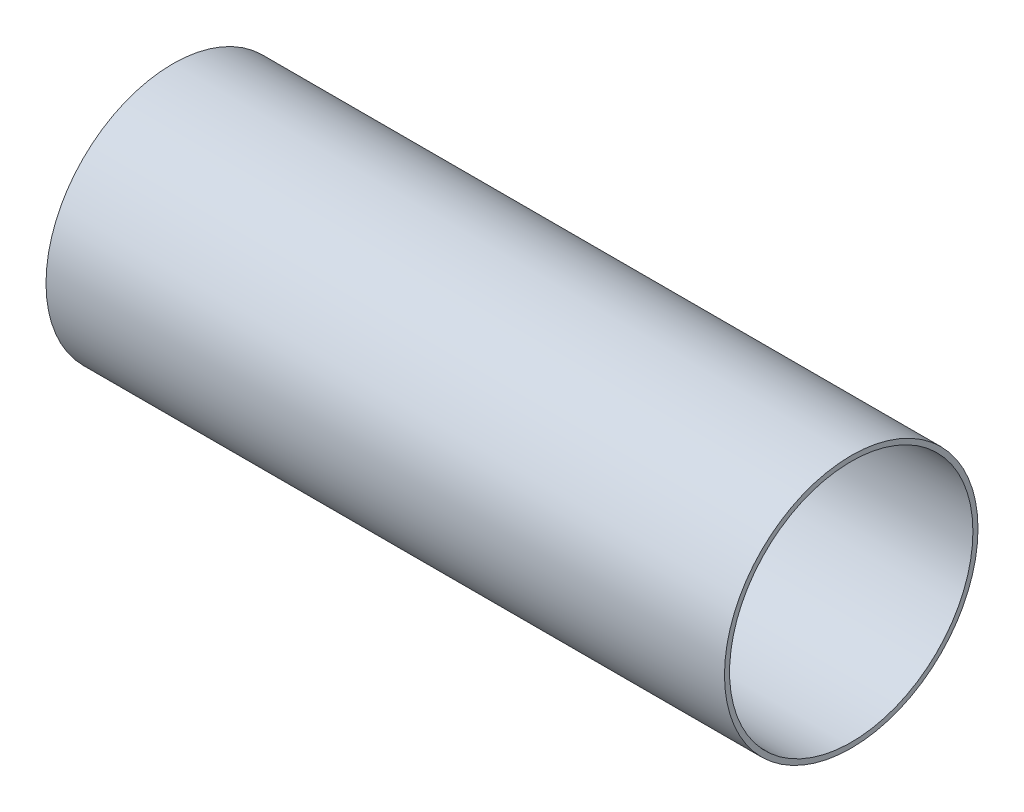
ISO-10303-21;
HEADER;
FILE_DESCRIPTION(('STEP AP214'),'2;1');
FILE_NAME('part.step','',(''),(''),'','','');
FILE_SCHEMA(('AUTOMOTIVE_DESIGN { 1 0 10303 214 1 1 1 1 }'));
ENDSEC;
DATA;
#1=APPLICATION_CONTEXT('core data for automotive mechanical design processes');
#2=APPLICATION_PROTOCOL_DEFINITION('international standard','automotive_design',2000,#1);
#3=PRODUCT_CONTEXT('',#1,'mechanical');
#4=PRODUCT('Part','Part','',(#3));
#5=PRODUCT_RELATED_PRODUCT_CATEGORY('part','',(#4));
#6=PRODUCT_DEFINITION_FORMATION('','',#4);
#7=PRODUCT_DEFINITION_CONTEXT('part definition',#1,'design');
#8=PRODUCT_DEFINITION('design','',#6,#7);
#9=PRODUCT_DEFINITION_SHAPE('','',#8);
#10=(LENGTH_UNIT() NAMED_UNIT(*) SI_UNIT(.MILLI.,.METRE.));
#11=(NAMED_UNIT(*) PLANE_ANGLE_UNIT() SI_UNIT($,.RADIAN.));
#12=(NAMED_UNIT(*) SI_UNIT($,.STERADIAN.) SOLID_ANGLE_UNIT());
#13=UNCERTAINTY_MEASURE_WITH_UNIT(LENGTH_MEASURE(1.E-05),#10,'distance_accuracy_value','');
#14=(GEOMETRIC_REPRESENTATION_CONTEXT(3) GLOBAL_UNCERTAINTY_ASSIGNED_CONTEXT((#13)) GLOBAL_UNIT_ASSIGNED_CONTEXT((#10,
#11,#12)) REPRESENTATION_CONTEXT('',''));
#15=CARTESIAN_POINT('',(0.,0.,0.));
#16=DIRECTION('',(0.,0.,1.));
#17=DIRECTION('',(1.,0.,0.));
#18=AXIS2_PLACEMENT_3D('',#15,#16,#17);
#19=CARTESIAN_POINT('',(152.4,0.,0.));
#20=DIRECTION('',(1.,0.,0.));
#21=DIRECTION('',(0.,0.,-1.));
#22=AXIS2_PLACEMENT_3D('',#19,#20,#21);
#23=PLANE('',#22);
#24=CARTESIAN_POINT('',(152.4,0.,0.));
#25=DIRECTION('',(1.,0.,0.));
#26=DIRECTION('',(0.,0.,-1.));
#27=AXIS2_PLACEMENT_3D('',#24,#25,#26);
#28=CIRCLE('',#27,28.4734);
#29=CARTESIAN_POINT('',(152.4,0.,-28.4734));
#30=VERTEX_POINT('',#29);
#31=EDGE_CURVE('E10',#30,#30,#28,.T.);
#32=ORIENTED_EDGE('',*,*,#31,.T.);
#33=EDGE_LOOP('',(#32));
#34=FACE_BOUND('',#33,.T.);
#35=CARTESIAN_POINT('',(152.4,0.,0.));
#36=DIRECTION('',(1.,0.,0.));
#37=DIRECTION('',(0.,0.,-1.));
#38=AXIS2_PLACEMENT_3D('',#35,#36,#37);
#39=CIRCLE('',#38,27.3304);
#40=CARTESIAN_POINT('',(152.4,0.,-27.3304));
#41=VERTEX_POINT('',#40);
#42=EDGE_CURVE('E47',#41,#41,#39,.T.);
#43=ORIENTED_EDGE('',*,*,#42,.F.);
#44=EDGE_LOOP('',(#43));
#45=FACE_BOUND('',#44,.T.);
#46=ADVANCED_FACE('F36',(#34,#45),#23,.T.);
#47=CARTESIAN_POINT('',(0.,0.,0.));
#48=DIRECTION('',(1.,0.,0.));
#49=DIRECTION('',(0.,0.,-1.));
#50=AXIS2_PLACEMENT_3D('',#47,#48,#49);
#51=PLANE('',#50);
#52=CARTESIAN_POINT('',(0.,0.,0.));
#53=DIRECTION('',(1.,0.,0.));
#54=DIRECTION('',(0.,0.,-1.));
#55=AXIS2_PLACEMENT_3D('',#52,#53,#54);
#56=CIRCLE('',#55,28.4734);
#57=CARTESIAN_POINT('',(0.,0.,-28.4734));
#58=VERTEX_POINT('',#57);
#59=EDGE_CURVE('E40',#58,#58,#56,.T.);
#60=ORIENTED_EDGE('',*,*,#59,.F.);
#61=EDGE_LOOP('',(#60));
#62=FACE_BOUND('',#61,.T.);
#63=CARTESIAN_POINT('',(0.,0.,0.));
#64=DIRECTION('',(1.,0.,0.));
#65=DIRECTION('',(0.,0.,-1.));
#66=AXIS2_PLACEMENT_3D('',#63,#64,#65);
#67=CIRCLE('',#66,27.3304);
#68=CARTESIAN_POINT('',(0.,0.,-27.3304));
#69=VERTEX_POINT('',#68);
#70=EDGE_CURVE('E49',#69,#69,#67,.T.);
#71=ORIENTED_EDGE('',*,*,#70,.T.);
#72=EDGE_LOOP('',(#71));
#73=FACE_BOUND('',#72,.T.);
#74=ADVANCED_FACE('F59',(#62,#73),#51,.F.);
#75=CARTESIAN_POINT('',(152.4,0.,0.));
#76=DIRECTION('',(-1.,0.,0.));
#77=DIRECTION('',(0.,0.,1.));
#78=AXIS2_PLACEMENT_3D('',#75,#76,#77);
#79=CYLINDRICAL_SURFACE('',#78,28.4734);
#80=ORIENTED_EDGE('',*,*,#31,.F.);
#81=EDGE_LOOP('',(#80));
#82=FACE_BOUND('',#81,.T.);
#83=ORIENTED_EDGE('',*,*,#59,.T.);
#84=EDGE_LOOP('',(#83));
#85=FACE_BOUND('',#84,.T.);
#86=ADVANCED_FACE('F38',(#82,#85),#79,.T.);
#87=CARTESIAN_POINT('',(152.4,0.,0.));
#88=DIRECTION('',(-1.,0.,0.));
#89=DIRECTION('',(0.,0.,1.));
#90=AXIS2_PLACEMENT_3D('',#87,#88,#89);
#91=CYLINDRICAL_SURFACE('',#90,27.3304);
#92=ORIENTED_EDGE('',*,*,#42,.T.);
#93=EDGE_LOOP('',(#92));
#94=FACE_BOUND('',#93,.T.);
#95=ORIENTED_EDGE('',*,*,#70,.F.);
#96=EDGE_LOOP('',(#95));
#97=FACE_BOUND('',#96,.T.);
#98=ADVANCED_FACE('F55',(#94,#97),#91,.F.);
#99=CLOSED_SHELL('',(#46,#74,#86,#98));
#100=MANIFOLD_SOLID_BREP('B2',#99);
#101=ADVANCED_BREP_SHAPE_REPRESENTATION('',(#18,#100),#14);
#102=SHAPE_DEFINITION_REPRESENTATION(#9,#101);
ENDSEC;
END-ISO-10303-21;
